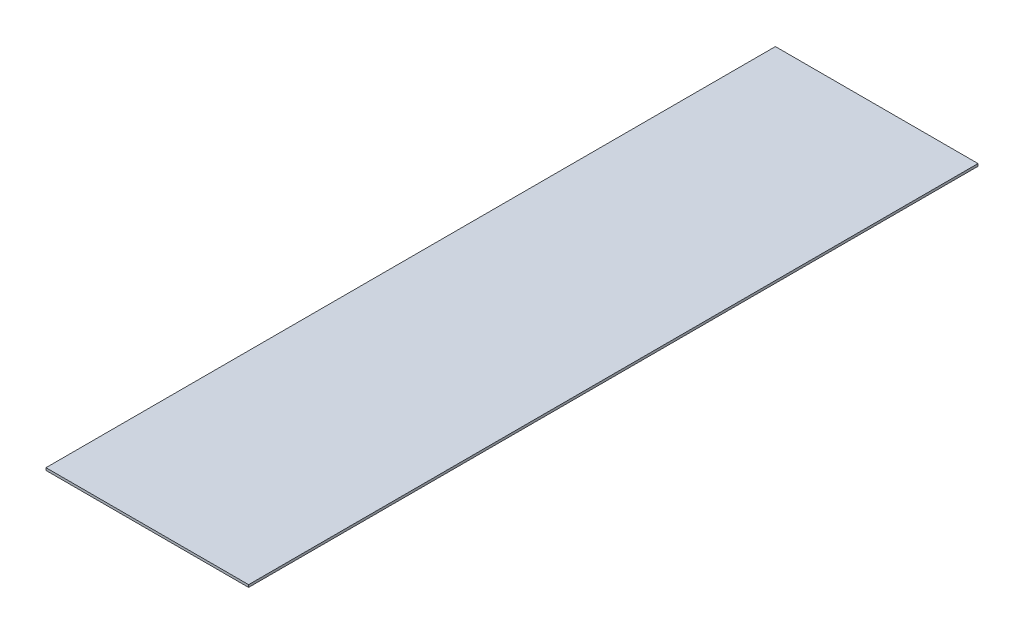
ISO-10303-21;
HEADER;
FILE_DESCRIPTION(('STEP AP214'),'2;1');
FILE_NAME('part.step','',(''),(''),'','','');
FILE_SCHEMA(('AUTOMOTIVE_DESIGN { 1 0 10303 214 1 1 1 1 }'));
ENDSEC;
DATA;
#1=APPLICATION_CONTEXT('core data for automotive mechanical design processes');
#2=APPLICATION_PROTOCOL_DEFINITION('international standard','automotive_design',2000,#1);
#3=PRODUCT_CONTEXT('',#1,'mechanical');
#4=PRODUCT('Part','Part','',(#3));
#5=PRODUCT_RELATED_PRODUCT_CATEGORY('part','',(#4));
#6=PRODUCT_DEFINITION_FORMATION('','',#4);
#7=PRODUCT_DEFINITION_CONTEXT('part definition',#1,'design');
#8=PRODUCT_DEFINITION('design','',#6,#7);
#9=PRODUCT_DEFINITION_SHAPE('','',#8);
#10=(LENGTH_UNIT() NAMED_UNIT(*) SI_UNIT(.MILLI.,.METRE.));
#11=(NAMED_UNIT(*) PLANE_ANGLE_UNIT() SI_UNIT($,.RADIAN.));
#12=(NAMED_UNIT(*) SI_UNIT($,.STERADIAN.) SOLID_ANGLE_UNIT());
#13=UNCERTAINTY_MEASURE_WITH_UNIT(LENGTH_MEASURE(1.E-05),#10,'distance_accuracy_value','');
#14=(GEOMETRIC_REPRESENTATION_CONTEXT(3) GLOBAL_UNCERTAINTY_ASSIGNED_CONTEXT((#13)) GLOBAL_UNIT_ASSIGNED_CONTEXT((#10,
#11,#12)) REPRESENTATION_CONTEXT('',''));
#15=CARTESIAN_POINT('',(0.,0.,0.));
#16=DIRECTION('',(0.,0.,1.));
#17=DIRECTION('',(1.,0.,0.));
#18=AXIS2_PLACEMENT_3D('',#15,#16,#17);
#19=CARTESIAN_POINT('',(0.,0.,900.));
#20=DIRECTION('',(1.,0.,0.));
#21=DIRECTION('',(0.,0.,-1.));
#22=AXIS2_PLACEMENT_3D('',#19,#20,#21);
#23=PLANE('',#22);
#24=DIRECTION('',(0.,-1.,0.));
#25=VECTOR('',#24,1.);
#26=CARTESIAN_POINT('',(0.,0.,0.));
#27=LINE('',#26,#25);
#28=CARTESIAN_POINT('',(0.,3.,0.));
#29=VERTEX_POINT('',#28);
#30=CARTESIAN_POINT('',(0.,0.,0.));
#31=VERTEX_POINT('',#30);
#32=EDGE_CURVE('E96',#29,#31,#27,.T.);
#33=ORIENTED_EDGE('',*,*,#32,.T.);
#34=DIRECTION('',(0.,0.,-1.));
#35=VECTOR('',#34,1.);
#36=CARTESIAN_POINT('',(0.,0.,900.));
#37=LINE('',#36,#35);
#38=CARTESIAN_POINT('',(0.,0.,900.));
#39=VERTEX_POINT('',#38);
#40=EDGE_CURVE('E11',#39,#31,#37,.T.);
#41=ORIENTED_EDGE('',*,*,#40,.F.);
#42=DIRECTION('',(0.,-1.,0.));
#43=VECTOR('',#42,1.);
#44=CARTESIAN_POINT('',(0.,0.,900.));
#45=LINE('',#44,#43);
#46=CARTESIAN_POINT('',(0.,3.,900.));
#47=VERTEX_POINT('',#46);
#48=EDGE_CURVE('E84',#47,#39,#45,.T.);
#49=ORIENTED_EDGE('',*,*,#48,.F.);
#50=DIRECTION('',(0.,0.,-1.));
#51=VECTOR('',#50,1.);
#52=CARTESIAN_POINT('',(0.,3.,900.));
#53=LINE('',#52,#51);
#54=EDGE_CURVE('E92',#47,#29,#53,.T.);
#55=ORIENTED_EDGE('',*,*,#54,.T.);
#56=EDGE_LOOP('',(#33,#41,#49,#55));
#57=FACE_BOUND('',#56,.T.);
#58=ADVANCED_FACE('F33',(#57),#23,.F.);
#59=CARTESIAN_POINT('',(0.,0.,900.));
#60=DIRECTION('',(0.,1.,0.));
#61=DIRECTION('',(0.,0.,1.));
#62=AXIS2_PLACEMENT_3D('',#59,#60,#61);
#63=PLANE('',#62);
#64=DIRECTION('',(1.,0.,0.));
#65=VECTOR('',#64,1.);
#66=CARTESIAN_POINT('',(0.,0.,0.));
#67=LINE('',#66,#65);
#68=CARTESIAN_POINT('',(250.,0.,0.));
#69=VERTEX_POINT('',#68);
#70=EDGE_CURVE('E88',#31,#69,#67,.T.);
#71=ORIENTED_EDGE('',*,*,#70,.T.);
#72=DIRECTION('',(0.,0.,-1.));
#73=VECTOR('',#72,1.);
#74=CARTESIAN_POINT('',(250.,0.,900.));
#75=LINE('',#74,#73);
#76=CARTESIAN_POINT('',(250.,0.,900.));
#77=VERTEX_POINT('',#76);
#78=EDGE_CURVE('E41',#77,#69,#75,.T.);
#79=ORIENTED_EDGE('',*,*,#78,.F.);
#80=DIRECTION('',(1.,0.,0.));
#81=VECTOR('',#80,1.);
#82=CARTESIAN_POINT('',(0.,0.,900.));
#83=LINE('',#82,#81);
#84=EDGE_CURVE('E79',#39,#77,#83,.T.);
#85=ORIENTED_EDGE('',*,*,#84,.F.);
#86=ORIENTED_EDGE('',*,*,#40,.T.);
#87=EDGE_LOOP('',(#71,#79,#85,#86));
#88=FACE_BOUND('',#87,.T.);
#89=ADVANCED_FACE('F87',(#88),#63,.F.);
#90=CARTESIAN_POINT('',(250.,0.,900.));
#91=DIRECTION('',(-1.,0.,0.));
#92=DIRECTION('',(0.,0.,1.));
#93=AXIS2_PLACEMENT_3D('',#90,#91,#92);
#94=PLANE('',#93);
#95=DIRECTION('',(0.,1.,0.));
#96=VECTOR('',#95,1.);
#97=CARTESIAN_POINT('',(250.,0.,0.));
#98=LINE('',#97,#96);
#99=CARTESIAN_POINT('',(250.,3.,0.));
#100=VERTEX_POINT('',#99);
#101=EDGE_CURVE('E66',#69,#100,#98,.T.);
#102=ORIENTED_EDGE('',*,*,#101,.T.);
#103=DIRECTION('',(0.,0.,-1.));
#104=VECTOR('',#103,1.);
#105=CARTESIAN_POINT('',(250.,3.,900.));
#106=LINE('',#105,#104);
#107=CARTESIAN_POINT('',(250.,3.,900.));
#108=VERTEX_POINT('',#107);
#109=EDGE_CURVE('E89',#108,#100,#106,.T.);
#110=ORIENTED_EDGE('',*,*,#109,.F.);
#111=DIRECTION('',(0.,1.,0.));
#112=VECTOR('',#111,1.);
#113=CARTESIAN_POINT('',(250.,0.,900.));
#114=LINE('',#113,#112);
#115=EDGE_CURVE('E82',#77,#108,#114,.T.);
#116=ORIENTED_EDGE('',*,*,#115,.F.);
#117=ORIENTED_EDGE('',*,*,#78,.T.);
#118=EDGE_LOOP('',(#102,#110,#116,#117));
#119=FACE_BOUND('',#118,.T.);
#120=ADVANCED_FACE('F90',(#119),#94,.F.);
#121=CARTESIAN_POINT('',(0.,3.,900.));
#122=DIRECTION('',(0.,-1.,0.));
#123=DIRECTION('',(1.,0.,0.));
#124=AXIS2_PLACEMENT_3D('',#121,#122,#123);
#125=PLANE('',#124);
#126=DIRECTION('',(-1.,0.,0.));
#127=VECTOR('',#126,1.);
#128=CARTESIAN_POINT('',(0.,3.,0.));
#129=LINE('',#128,#127);
#130=EDGE_CURVE('E72',#100,#29,#129,.T.);
#131=ORIENTED_EDGE('',*,*,#130,.T.);
#132=ORIENTED_EDGE('',*,*,#54,.F.);
#133=DIRECTION('',(-1.,0.,0.));
#134=VECTOR('',#133,1.);
#135=CARTESIAN_POINT('',(0.,3.,900.));
#136=LINE('',#135,#134);
#137=EDGE_CURVE('E49',#108,#47,#136,.T.);
#138=ORIENTED_EDGE('',*,*,#137,.F.);
#139=ORIENTED_EDGE('',*,*,#109,.T.);
#140=EDGE_LOOP('',(#131,#132,#138,#139));
#141=FACE_BOUND('',#140,.T.);
#142=ADVANCED_FACE('F103',(#141),#125,.F.);
#143=CARTESIAN_POINT('',(0.,0.,900.));
#144=DIRECTION('',(0.,0.,-1.));
#145=DIRECTION('',(-1.,0.,0.));
#146=AXIS2_PLACEMENT_3D('',#143,#144,#145);
#147=PLANE('',#146);
#148=ORIENTED_EDGE('',*,*,#48,.T.);
#149=ORIENTED_EDGE('',*,*,#84,.T.);
#150=ORIENTED_EDGE('',*,*,#115,.T.);
#151=ORIENTED_EDGE('',*,*,#137,.T.);
#152=EDGE_LOOP('',(#148,#149,#150,#151));
#153=FACE_BOUND('',#152,.T.);
#154=ADVANCED_FACE('F80',(#153),#147,.F.);
#155=CARTESIAN_POINT('',(0.,0.,0.));
#156=DIRECTION('',(0.,0.,-1.));
#157=DIRECTION('',(-1.,0.,0.));
#158=AXIS2_PLACEMENT_3D('',#155,#156,#157);
#159=PLANE('',#158);
#160=ORIENTED_EDGE('',*,*,#32,.F.);
#161=ORIENTED_EDGE('',*,*,#130,.F.);
#162=ORIENTED_EDGE('',*,*,#101,.F.);
#163=ORIENTED_EDGE('',*,*,#70,.F.);
#164=EDGE_LOOP('',(#160,#161,#162,#163));
#165=FACE_BOUND('',#164,.T.);
#166=ADVANCED_FACE('F106',(#165),#159,.T.);
#167=CLOSED_SHELL('',(#58,#89,#120,#142,#154,#166));
#168=MANIFOLD_SOLID_BREP('B2',#167);
#169=ADVANCED_BREP_SHAPE_REPRESENTATION('',(#18,#168),#14);
#170=SHAPE_DEFINITION_REPRESENTATION(#9,#169);
ENDSEC;
END-ISO-10303-21;
